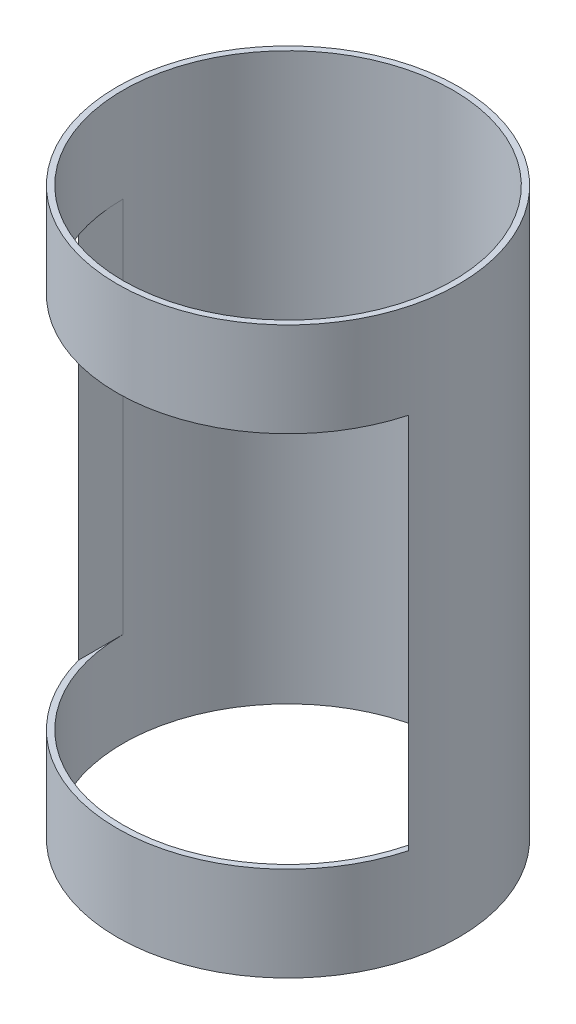
ISO-10303-21;
HEADER;
FILE_DESCRIPTION(('STEP AP214'),'2;1');
FILE_NAME('part.step','',(''),(''),'','','');
FILE_SCHEMA(('AUTOMOTIVE_DESIGN { 1 0 10303 214 1 1 1 1 }'));
ENDSEC;
DATA;
#1=APPLICATION_CONTEXT('core data for automotive mechanical design processes');
#2=APPLICATION_PROTOCOL_DEFINITION('international standard','automotive_design',2000,#1);
#3=PRODUCT_CONTEXT('',#1,'mechanical');
#4=PRODUCT('Part','Part','',(#3));
#5=PRODUCT_RELATED_PRODUCT_CATEGORY('part','',(#4));
#6=PRODUCT_DEFINITION_FORMATION('','',#4);
#7=PRODUCT_DEFINITION_CONTEXT('part definition',#1,'design');
#8=PRODUCT_DEFINITION('design','',#6,#7);
#9=PRODUCT_DEFINITION_SHAPE('','',#8);
#10=(LENGTH_UNIT() NAMED_UNIT(*) SI_UNIT(.MILLI.,.METRE.));
#11=(NAMED_UNIT(*) PLANE_ANGLE_UNIT() SI_UNIT($,.RADIAN.));
#12=(NAMED_UNIT(*) SI_UNIT($,.STERADIAN.) SOLID_ANGLE_UNIT());
#13=UNCERTAINTY_MEASURE_WITH_UNIT(LENGTH_MEASURE(1.E-05),#10,'distance_accuracy_value','');
#14=(GEOMETRIC_REPRESENTATION_CONTEXT(3) GLOBAL_UNCERTAINTY_ASSIGNED_CONTEXT((#13)) GLOBAL_UNIT_ASSIGNED_CONTEXT((#10,
#11,#12)) REPRESENTATION_CONTEXT('',''));
#15=CARTESIAN_POINT('',(0.,0.,0.));
#16=DIRECTION('',(0.,0.,1.));
#17=DIRECTION('',(1.,0.,0.));
#18=AXIS2_PLACEMENT_3D('',#15,#16,#17);
#19=CARTESIAN_POINT('',(0.,304.8,0.));
#20=DIRECTION('',(0.,-1.,0.));
#21=DIRECTION('',(0.,0.,-1.));
#22=AXIS2_PLACEMENT_3D('',#19,#20,#21);
#23=CYLINDRICAL_SURFACE('',#22,92.0749999999999);
#24=CARTESIAN_POINT('',(0.,304.8,0.));
#25=DIRECTION('',(0.,1.,0.));
#26=DIRECTION('',(0.,0.,1.));
#27=AXIS2_PLACEMENT_3D('',#24,#25,#26);
#28=CIRCLE('',#27,92.0749999999999);
#29=CARTESIAN_POINT('',(0.,304.8,92.0749999999999));
#30=VERTEX_POINT('',#29);
#31=EDGE_CURVE('E113',#30,#30,#28,.T.);
#32=ORIENTED_EDGE('',*,*,#31,.F.);
#33=EDGE_LOOP('',(#32));
#34=FACE_BOUND('',#33,.T.);
#35=CARTESIAN_POINT('',(0.,0.,0.));
#36=DIRECTION('',(0.,1.,0.));
#37=DIRECTION('',(0.,0.,1.));
#38=AXIS2_PLACEMENT_3D('',#35,#36,#37);
#39=CIRCLE('',#38,92.0749999999999);
#40=CARTESIAN_POINT('',(0.,0.,92.0749999999999));
#41=VERTEX_POINT('',#40);
#42=EDGE_CURVE('E110',#41,#41,#39,.T.);
#43=ORIENTED_EDGE('',*,*,#42,.T.);
#44=EDGE_LOOP('',(#43));
#45=FACE_BOUND('',#44,.T.);
#46=CARTESIAN_POINT('',(0.,50.8,0.));
#47=DIRECTION('',(0.,1.,0.));
#48=DIRECTION('',(0.,0.,1.));
#49=AXIS2_PLACEMENT_3D('',#46,#47,#48);
#50=CIRCLE('',#49,92.0749999999999);
#51=CARTESIAN_POINT('',(-88.9,50.8,23.9707243319842));
#52=VERTEX_POINT('',#51);
#53=CARTESIAN_POINT('',(88.9,50.8,23.9707243319843));
#54=VERTEX_POINT('',#53);
#55=EDGE_CURVE('E47',#52,#54,#50,.T.);
#56=ORIENTED_EDGE('',*,*,#55,.F.);
#57=DIRECTION('',(0.,-1.,0.));
#58=VECTOR('',#57,1.);
#59=CARTESIAN_POINT('',(-88.9,304.8,23.9707243319842));
#60=LINE('',#59,#58);
#61=CARTESIAN_POINT('',(-88.9,254.,23.9707243319842));
#62=VERTEX_POINT('',#61);
#63=EDGE_CURVE('E101',#62,#52,#60,.T.);
#64=ORIENTED_EDGE('',*,*,#63,.F.);
#65=CARTESIAN_POINT('',(0.,254.,0.));
#66=DIRECTION('',(0.,-1.,0.));
#67=DIRECTION('',(0.,0.,-1.));
#68=AXIS2_PLACEMENT_3D('',#65,#66,#67);
#69=CIRCLE('',#68,92.0749999999999);
#70=CARTESIAN_POINT('',(88.9,254.,23.9707243319843));
#71=VERTEX_POINT('',#70);
#72=EDGE_CURVE('E103',#71,#62,#69,.T.);
#73=ORIENTED_EDGE('',*,*,#72,.F.);
#74=DIRECTION('',(0.,-1.,0.));
#75=VECTOR('',#74,1.);
#76=CARTESIAN_POINT('',(88.9,304.8,23.9707243319843));
#77=LINE('',#76,#75);
#78=EDGE_CURVE('E89',#54,#71,#77,.F.);
#79=ORIENTED_EDGE('',*,*,#78,.F.);
#80=EDGE_LOOP('',(#56,#64,#73,#79));
#81=FACE_BOUND('',#80,.T.);
#82=ADVANCED_FACE('F33',(#34,#45,#81),#23,.T.);
#83=CARTESIAN_POINT('',(0.,304.8,0.));
#84=DIRECTION('',(0.,-1.,0.));
#85=DIRECTION('',(0.,0.,-1.));
#86=AXIS2_PLACEMENT_3D('',#83,#84,#85);
#87=CYLINDRICAL_SURFACE('',#86,88.9000000000002);
#88=CARTESIAN_POINT('',(0.,304.8,0.));
#89=DIRECTION('',(0.,1.,0.));
#90=DIRECTION('',(0.,0.,1.));
#91=AXIS2_PLACEMENT_3D('',#88,#89,#90);
#92=CIRCLE('',#91,88.9000000000002);
#93=CARTESIAN_POINT('',(0.,304.8,88.9000000000002));
#94=VERTEX_POINT('',#93);
#95=EDGE_CURVE('E107',#94,#94,#92,.T.);
#96=ORIENTED_EDGE('',*,*,#95,.T.);
#97=EDGE_LOOP('',(#96));
#98=FACE_BOUND('',#97,.T.);
#99=CARTESIAN_POINT('',(0.,0.,0.));
#100=DIRECTION('',(0.,1.,0.));
#101=DIRECTION('',(0.,0.,1.));
#102=AXIS2_PLACEMENT_3D('',#99,#100,#101);
#103=CIRCLE('',#102,88.9000000000002);
#104=CARTESIAN_POINT('',(0.,0.,88.9000000000002));
#105=VERTEX_POINT('',#104);
#106=EDGE_CURVE('E106',#105,#105,#103,.T.);
#107=ORIENTED_EDGE('',*,*,#106,.F.);
#108=EDGE_LOOP('',(#107));
#109=FACE_BOUND('',#108,.T.);
#110=DIRECTION('',(0.,1.,0.));
#111=VECTOR('',#110,1.);
#112=CARTESIAN_POINT('',(88.9,50.8,0.));
#113=LINE('',#112,#111);
#114=CARTESIAN_POINT('',(88.9,50.8,0.));
#115=VERTEX_POINT('',#114);
#116=CARTESIAN_POINT('',(88.9,254.,0.));
#117=VERTEX_POINT('',#116);
#118=EDGE_CURVE('E87',#115,#117,#113,.T.);
#119=ORIENTED_EDGE('',*,*,#118,.T.);
#120=CARTESIAN_POINT('',(0.,254.,0.));
#121=DIRECTION('',(0.,-1.,0.));
#122=DIRECTION('',(0.,0.,-1.));
#123=AXIS2_PLACEMENT_3D('',#120,#121,#122);
#124=CIRCLE('',#123,88.9000000000002);
#125=CARTESIAN_POINT('',(-88.9,254.,0.));
#126=VERTEX_POINT('',#125);
#127=EDGE_CURVE('E11',#117,#126,#124,.T.);
#128=ORIENTED_EDGE('',*,*,#127,.T.);
#129=DIRECTION('',(0.,-1.,0.));
#130=VECTOR('',#129,1.);
#131=CARTESIAN_POINT('',(-88.9,50.8,0.));
#132=LINE('',#131,#130);
#133=CARTESIAN_POINT('',(-88.9000000000002,50.8,0.));
#134=VERTEX_POINT('',#133);
#135=EDGE_CURVE('E92',#126,#134,#132,.T.);
#136=ORIENTED_EDGE('',*,*,#135,.T.);
#137=CARTESIAN_POINT('',(0.,50.8,0.));
#138=DIRECTION('',(0.,1.,0.));
#139=DIRECTION('',(0.,0.,1.));
#140=AXIS2_PLACEMENT_3D('',#137,#138,#139);
#141=CIRCLE('',#140,88.9000000000002);
#142=EDGE_CURVE('E40',#134,#115,#141,.T.);
#143=ORIENTED_EDGE('',*,*,#142,.T.);
#144=EDGE_LOOP('',(#119,#128,#136,#143));
#145=FACE_BOUND('',#144,.T.);
#146=ADVANCED_FACE('F91',(#98,#109,#145),#87,.F.);
#147=CARTESIAN_POINT('',(0.,304.8,0.));
#148=DIRECTION('',(0.,1.,0.));
#149=DIRECTION('',(0.,0.,1.));
#150=AXIS2_PLACEMENT_3D('',#147,#148,#149);
#151=PLANE('',#150);
#152=ORIENTED_EDGE('',*,*,#31,.T.);
#153=EDGE_LOOP('',(#152));
#154=FACE_BOUND('',#153,.T.);
#155=ORIENTED_EDGE('',*,*,#95,.F.);
#156=EDGE_LOOP('',(#155));
#157=FACE_BOUND('',#156,.T.);
#158=ADVANCED_FACE('F123',(#154,#157),#151,.T.);
#159=CARTESIAN_POINT('',(0.,0.,0.));
#160=DIRECTION('',(0.,1.,0.));
#161=DIRECTION('',(0.,0.,1.));
#162=AXIS2_PLACEMENT_3D('',#159,#160,#161);
#163=PLANE('',#162);
#164=ORIENTED_EDGE('',*,*,#42,.F.);
#165=EDGE_LOOP('',(#164));
#166=FACE_BOUND('',#165,.T.);
#167=ORIENTED_EDGE('',*,*,#106,.T.);
#168=EDGE_LOOP('',(#167));
#169=FACE_BOUND('',#168,.T.);
#170=ADVANCED_FACE('F120',(#166,#169),#163,.F.);
#171=CARTESIAN_POINT('',(88.9,50.8,92.0749999999999));
#172=DIRECTION('',(-1.,0.,0.));
#173=DIRECTION('',(0.,0.,1.));
#174=AXIS2_PLACEMENT_3D('',#171,#172,#173);
#175=PLANE('',#174);
#176=ORIENTED_EDGE('',*,*,#78,.T.);
#177=DIRECTION('',(0.,0.,-1.));
#178=VECTOR('',#177,1.);
#179=CARTESIAN_POINT('',(88.9,254.,92.0749999999999));
#180=LINE('',#179,#178);
#181=EDGE_CURVE('E76',#71,#117,#180,.T.);
#182=ORIENTED_EDGE('',*,*,#181,.T.);
#183=ORIENTED_EDGE('',*,*,#118,.F.);
#184=DIRECTION('',(0.,0.,-1.));
#185=VECTOR('',#184,1.);
#186=CARTESIAN_POINT('',(88.9,50.8,92.0749999999999));
#187=LINE('',#186,#185);
#188=EDGE_CURVE('E94',#54,#115,#187,.T.);
#189=ORIENTED_EDGE('',*,*,#188,.F.);
#190=EDGE_LOOP('',(#176,#182,#183,#189));
#191=FACE_BOUND('',#190,.T.);
#192=ADVANCED_FACE('F85',(#191),#175,.T.);
#193=CARTESIAN_POINT('',(-88.9,254.,92.0749999999999));
#194=DIRECTION('',(0.,-1.,0.));
#195=DIRECTION('',(0.,0.,-1.));
#196=AXIS2_PLACEMENT_3D('',#193,#194,#195);
#197=PLANE('',#196);
#198=ORIENTED_EDGE('',*,*,#72,.T.);
#199=DIRECTION('',(0.,0.,-1.));
#200=VECTOR('',#199,1.);
#201=CARTESIAN_POINT('',(-88.9,254.,92.0749999999999));
#202=LINE('',#201,#200);
#203=EDGE_CURVE('E79',#62,#126,#202,.T.);
#204=ORIENTED_EDGE('',*,*,#203,.T.);
#205=ORIENTED_EDGE('',*,*,#127,.F.);
#206=ORIENTED_EDGE('',*,*,#181,.F.);
#207=EDGE_LOOP('',(#198,#204,#205,#206));
#208=FACE_BOUND('',#207,.T.);
#209=ADVANCED_FACE('F75',(#208),#197,.T.);
#210=CARTESIAN_POINT('',(-88.9,50.8,92.0749999999999));
#211=DIRECTION('',(1.,0.,0.));
#212=DIRECTION('',(0.,0.,-1.));
#213=AXIS2_PLACEMENT_3D('',#210,#211,#212);
#214=PLANE('',#213);
#215=ORIENTED_EDGE('',*,*,#63,.T.);
#216=DIRECTION('',(0.,0.,-1.));
#217=VECTOR('',#216,1.);
#218=CARTESIAN_POINT('',(-88.9,50.8,92.0749999999999));
#219=LINE('',#218,#217);
#220=EDGE_CURVE('E54',#52,#134,#219,.T.);
#221=ORIENTED_EDGE('',*,*,#220,.T.);
#222=ORIENTED_EDGE('',*,*,#135,.F.);
#223=ORIENTED_EDGE('',*,*,#203,.F.);
#224=EDGE_LOOP('',(#215,#221,#222,#223));
#225=FACE_BOUND('',#224,.T.);
#226=ADVANCED_FACE('F141',(#225),#214,.T.);
#227=CARTESIAN_POINT('',(-88.9,50.8,92.0749999999999));
#228=DIRECTION('',(0.,1.,0.));
#229=DIRECTION('',(0.,0.,1.));
#230=AXIS2_PLACEMENT_3D('',#227,#228,#229);
#231=PLANE('',#230);
#232=ORIENTED_EDGE('',*,*,#55,.T.);
#233=ORIENTED_EDGE('',*,*,#188,.T.);
#234=ORIENTED_EDGE('',*,*,#142,.F.);
#235=ORIENTED_EDGE('',*,*,#220,.F.);
#236=EDGE_LOOP('',(#232,#233,#234,#235));
#237=FACE_BOUND('',#236,.T.);
#238=ADVANCED_FACE('F144',(#237),#231,.T.);
#239=CLOSED_SHELL('',(#82,#146,#158,#170,#192,#209,#226,#238));
#240=MANIFOLD_SOLID_BREP('B2',#239);
#241=ADVANCED_BREP_SHAPE_REPRESENTATION('',(#18,#240),#14);
#242=SHAPE_DEFINITION_REPRESENTATION(#9,#241);
ENDSEC;
END-ISO-10303-21;
